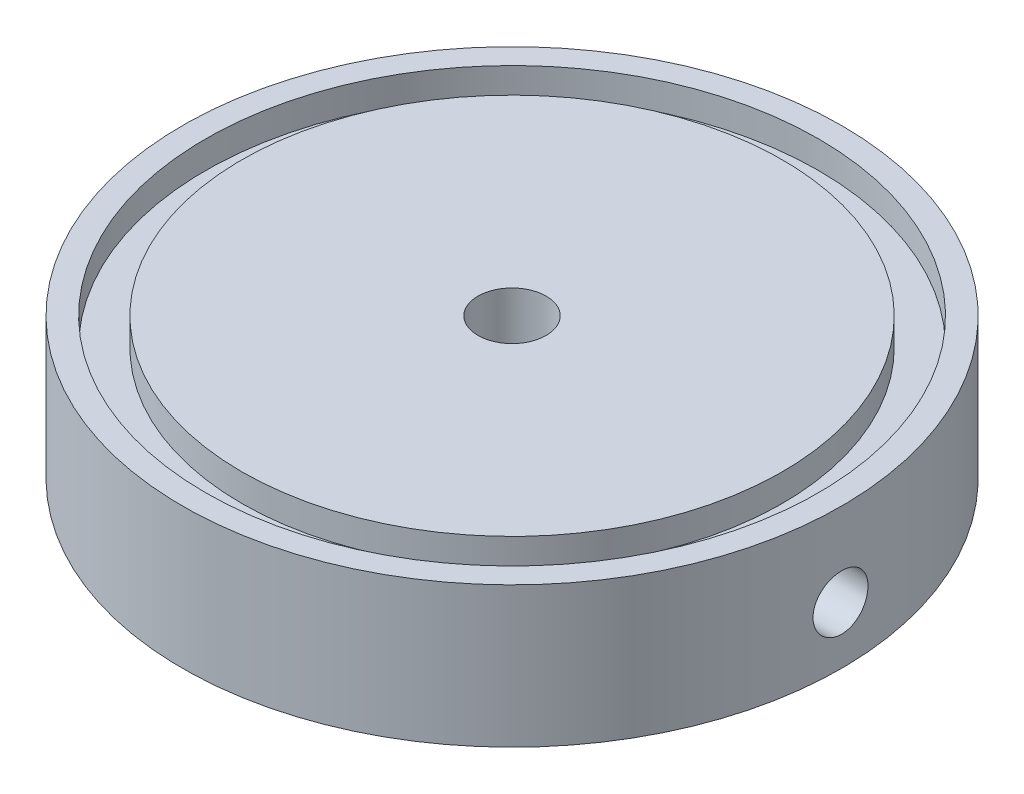
ISO-10303-21;
HEADER;
FILE_DESCRIPTION(('STEP AP214'),'2;1');
FILE_NAME('part.step','',(''),(''),'','','');
FILE_SCHEMA(('AUTOMOTIVE_DESIGN { 1 0 10303 214 1 1 1 1 }'));
ENDSEC;
DATA;
#1=APPLICATION_CONTEXT('core data for automotive mechanical design processes');
#2=APPLICATION_PROTOCOL_DEFINITION('international standard','automotive_design',2000,#1);
#3=PRODUCT_CONTEXT('',#1,'mechanical');
#4=PRODUCT('Part','Part','',(#3));
#5=PRODUCT_RELATED_PRODUCT_CATEGORY('part','',(#4));
#6=PRODUCT_DEFINITION_FORMATION('','',#4);
#7=PRODUCT_DEFINITION_CONTEXT('part definition',#1,'design');
#8=PRODUCT_DEFINITION('design','',#6,#7);
#9=PRODUCT_DEFINITION_SHAPE('','',#8);
#10=(LENGTH_UNIT() NAMED_UNIT(*) SI_UNIT(.MILLI.,.METRE.));
#11=(NAMED_UNIT(*) PLANE_ANGLE_UNIT() SI_UNIT($,.RADIAN.));
#12=(NAMED_UNIT(*) SI_UNIT($,.STERADIAN.) SOLID_ANGLE_UNIT());
#13=UNCERTAINTY_MEASURE_WITH_UNIT(LENGTH_MEASURE(1.E-05),#10,'distance_accuracy_value','');
#14=(GEOMETRIC_REPRESENTATION_CONTEXT(3) GLOBAL_UNCERTAINTY_ASSIGNED_CONTEXT((#13)) GLOBAL_UNIT_ASSIGNED_CONTEXT((#10,
#11,#12)) REPRESENTATION_CONTEXT('',''));
#15=CARTESIAN_POINT('',(0.,0.,0.));
#16=DIRECTION('',(0.,0.,1.));
#17=DIRECTION('',(1.,0.,0.));
#18=AXIS2_PLACEMENT_3D('',#15,#16,#17);
#19=CARTESIAN_POINT('',(38.1,-2.21742000000442,0.));
#20=DIRECTION('',(-1.,0.,0.));
#21=DIRECTION('',(0.,0.,1.));
#22=AXIS2_PLACEMENT_3D('',#19,#20,#21);
#23=CYLINDRICAL_SURFACE('',#22,1.7272);
#24=CARTESIAN_POINT('',(4.78697067852523,-0.665171235261735,-0.757458653891286));
#25=CARTESIAN_POINT('',(4.75625422953606,-0.635930548996629,-0.697533372590927));
#26=CARTESIAN_POINT('',(4.72893216465884,-0.609470565960408,-0.634482388105727));
#27=CARTESIAN_POINT('',(4.68213605994151,-0.563643555776028,-0.50306921919846));
#28=CARTESIAN_POINT('',(4.66266042825234,-0.544275090005549,-0.43470811542969));
#29=CARTESIAN_POINT('',(4.63231211537771,-0.513889935709503,-0.293951985284614));
#30=CARTESIAN_POINT('',(4.62147760516662,-0.502910312618153,-0.221540556224796));
#31=CARTESIAN_POINT('',(4.60903870850558,-0.490291871867994,-0.0751217236692977));
#32=CARTESIAN_POINT('',(4.60743266312804,-0.4886513753893,-0.00111460941827956));
#33=CARTESIAN_POINT('',(4.61336361058703,-0.494679348910777,0.14245074301311));
#34=CARTESIAN_POINT('',(4.62045190693207,-0.501890992455949,0.212047848188066));
#35=CARTESIAN_POINT('',(4.64273463588662,-0.52434487711953,0.348574343831421));
#36=CARTESIAN_POINT('',(4.65792891984075,-0.539586970967784,0.415503783197841));
#37=CARTESIAN_POINT('',(4.69608404535905,-0.577354018883261,0.545967186595631));
#38=CARTESIAN_POINT('',(4.71914668265209,-0.599974248749584,0.609443314302014));
#39=CARTESIAN_POINT('',(4.77210476899229,-0.651100559562644,0.730899392454943));
#40=CARTESIAN_POINT('',(4.8020029862676,-0.67960902463503,0.78887710269346));
#41=CARTESIAN_POINT('',(4.88192024901478,-0.754526280160981,0.922671170204856));
#42=CARTESIAN_POINT('',(4.93503823722558,-0.803331738258821,0.995297986812561));
#43=CARTESIAN_POINT('',(5.05039924550062,-0.906776183432052,1.12807541459497));
#44=CARTESIAN_POINT('',(5.11266285154989,-0.961428253273451,1.18819712022933));
#45=CARTESIAN_POINT('',(5.27630299315434,-1.10192049508507,1.32385964569084));
#46=CARTESIAN_POINT('',(5.3817783180933,-1.18980158095095,1.39228992218148));
#47=CARTESIAN_POINT('',(5.60174638633848,-1.36815861695864,1.5077448471841));
#48=CARTESIAN_POINT('',(5.71625795579938,-1.45863972073563,1.55472334408847));
#49=CARTESIAN_POINT('',(5.92763078684595,-1.6221177422067,1.62328310146144));
#50=CARTESIAN_POINT('',(6.02354233176437,-1.69505896722171,1.64804007283235));
#51=CARTESIAN_POINT('',(6.21772870089238,-1.84064222160262,1.68729031027404));
#52=CARTESIAN_POINT('',(6.31600494010158,-1.91328403974576,1.70177726461788));
#53=CARTESIAN_POINT('',(6.51422110198702,-2.05805523217336,1.72138595920732));
#54=CARTESIAN_POINT('',(6.61416464288552,-2.13018281605391,1.72648360307503));
#55=CARTESIAN_POINT('',(6.81474196617157,-2.27348375977993,1.72777573553129));
#56=CARTESIAN_POINT('',(6.91537557639753,-2.34465734541485,1.72397236958763));
#57=CARTESIAN_POINT('',(7.12168455036751,-2.48933143282605,1.70729152009641));
#58=CARTESIAN_POINT('',(7.22736495397619,-2.56277469486742,1.69397784330079));
#59=CARTESIAN_POINT('',(7.43816471586283,-2.70817059405486,1.65770938961245));
#60=CARTESIAN_POINT('',(7.54328385102441,-2.78012266704927,1.63475103133998));
#61=CARTESIAN_POINT('',(7.75166250948726,-2.92184595478182,1.57885512147153));
#62=CARTESIAN_POINT('',(7.85492808751473,-2.99162522016489,1.54596092672259));
#63=CARTESIAN_POINT('',(8.05894219324114,-3.12874148339489,1.46931337138522));
#64=CARTESIAN_POINT('',(8.15969293261694,-3.19608065255697,1.42556995117591));
#65=CARTESIAN_POINT('',(8.34279146757036,-3.31790402197057,1.33308588479146));
#66=CARTESIAN_POINT('',(8.42567839901411,-3.37282958961099,1.28600741540689));
#67=CARTESIAN_POINT('',(8.58722294170047,-3.47952178902698,1.18148485729486));
#68=CARTESIAN_POINT('',(8.66587290467,-3.5312827295557,1.12402278843746));
#69=CARTESIAN_POINT('',(8.81730672629618,-3.63066638778965,0.996297196430853));
#70=CARTESIAN_POINT('',(8.89000397489234,-3.67822860021844,0.92588119298211));
#71=CARTESIAN_POINT('',(9.02390983800553,-3.76564177324054,0.770767288220577));
#72=CARTESIAN_POINT('',(9.08516940480062,-3.80552695907134,0.686136080992624));
#73=CARTESIAN_POINT('',(9.16525579997495,-3.85759296052293,0.543951134303041));
#74=CARTESIAN_POINT('',(9.19067638740805,-3.87410210849061,0.491712966462728));
#75=CARTESIAN_POINT('',(9.23445776303899,-3.90251839072471,0.383148433261553));
#76=CARTESIAN_POINT('',(9.25282485409157,-3.91442963363101,0.326825771481761));
#77=CARTESIAN_POINT('',(9.2810805548836,-3.93274790973384,0.210605150804604));
#78=CARTESIAN_POINT('',(9.29088987886069,-3.93910347186559,0.150679144383298));
#79=CARTESIAN_POINT('',(9.30064503860262,-3.94542396950302,0.0296980409525031));
#80=CARTESIAN_POINT('',(9.30059713576054,-3.94539296181135,-0.0313563146720226));
#81=CARTESIAN_POINT('',(9.29122890951459,-3.93932310941666,-0.14549919115933));
#82=CARTESIAN_POINT('',(9.28294617064534,-3.93395654173932,-0.19871495761312));
#83=CARTESIAN_POINT('',(9.25936944941119,-3.91867309715279,-0.302875861226293));
#84=CARTESIAN_POINT('',(9.24407157626598,-3.90875369511765,-0.353819721098759));
#85=CARTESIAN_POINT('',(9.20096314906789,-3.88078203616598,-0.470334270253999));
#86=CARTESIAN_POINT('',(9.17063082628091,-3.8610876329992,-0.534571115967057));
#87=CARTESIAN_POINT('',(9.10179725928312,-3.81633686068641,-0.656447461342044));
#88=CARTESIAN_POINT('',(9.06327774394699,-3.79126849753343,-0.71407175352864));
#89=CARTESIAN_POINT('',(8.95707802252543,-3.72204583322611,-0.853427038623287));
#90=CARTESIAN_POINT('',(8.88517496885591,-3.67508247862191,-0.930507716123498));
#91=CARTESIAN_POINT('',(8.73276113117903,-3.57522834803393,-1.07099258277773));
#92=CARTESIAN_POINT('',(8.65223087948544,-3.52232415272656,-1.13436482302106));
#93=CARTESIAN_POINT('',(8.4965509103134,-3.41968473971726,-1.24199663584822));
#94=CARTESIAN_POINT('',(8.42204803621105,-3.37042166648861,-1.2876673135239));
#95=CARTESIAN_POINT('',(8.27019868913385,-3.26966196891126,-1.37123845324186));
#96=CARTESIAN_POINT('',(8.19285021193152,-3.21816376553295,-1.40913331005771));
#97=CARTESIAN_POINT('',(8.03606737113653,-3.11336290973551,-1.47798619281361));
#98=CARTESIAN_POINT('',(7.9566289112447,-3.06005664361635,-1.50892925406542));
#99=CARTESIAN_POINT('',(7.79642991727826,-2.9520721804854,-1.56434901597961));
#100=CARTESIAN_POINT('',(7.71566903621436,-2.89739362132667,-1.58882398964756));
#101=CARTESIAN_POINT('',(7.51886407635085,-2.76346880539695,-1.64078665460497));
#102=CARTESIAN_POINT('',(7.40238391256857,-2.68363910098292,-1.66514898834206));
#103=CARTESIAN_POINT('',(7.16877253520805,-2.52213916613266,-1.70212491606884));
#104=CARTESIAN_POINT('',(7.05164099265636,-2.44046792696191,-1.71473190244668));
#105=CARTESIAN_POINT('',(6.81786246557642,-2.27575422936096,-1.72818887092601));
#106=CARTESIAN_POINT('',(6.70121506046376,-2.19271359547437,-1.72905340229935));
#107=CARTESIAN_POINT('',(6.46936664569442,-2.02557001776367,-1.718551954237));
#108=CARTESIAN_POINT('',(6.35416470504726,-1.94146783596734,-1.70719430424913));
#109=CARTESIAN_POINT('',(6.10612982867684,-1.75758824532498,-1.66797102101825));
#110=CARTESIAN_POINT('',(5.97377251112206,-1.65766333372211,-1.63754625658014));
#111=CARTESIAN_POINT('',(5.78024403318545,-1.50818878630032,-1.5757846531622));
#112=CARTESIAN_POINT('',(5.71659631436929,-1.45845476401426,-1.55252396450989));
#113=CARTESIAN_POINT('',(5.59146640663726,-1.35941418178603,-1.50006247466696));
#114=CARTESIAN_POINT('',(5.52998347762886,-1.31010748018511,-1.47086372715697));
#115=CARTESIAN_POINT('',(5.38728220140971,-1.19400874201817,-1.39369146486403));
#116=CARTESIAN_POINT('',(5.30730539323905,-1.12759071336931,-1.34278304649939));
#117=CARTESIAN_POINT('',(5.15519035730813,-0.998393264074577,-1.22666501174239));
#118=CARTESIAN_POINT('',(5.08303677989516,-0.935606835294663,-1.16148418671653));
#119=CARTESIAN_POINT('',(4.97257932380863,-0.837171800965483,-1.04018392483871));
#120=CARTESIAN_POINT('',(4.93111600422493,-0.799563137637129,-0.988538194437073));
#121=CARTESIAN_POINT('',(4.85421423295613,-0.728701068483842,-0.878195991255441));
#122=CARTESIAN_POINT('',(4.81877313109346,-0.695445748384531,-0.819502639407449));
#123=CARTESIAN_POINT('',(4.78697067852523,-0.665171235261735,-0.757458653891286));
#124=B_SPLINE_CURVE_WITH_KNOTS('',3,(#24,#25,#26,#27,#28,#29,#30,#31,#32,#33,#34,#35,#36,#37,
#38,#39,#40,#41,#42,#43,#44,#45,#46,#47,#48,#49,#50,#51,#52,#53,#54,#55,#56,#57,#58,#59,#60,#61,
#62,#63,#64,#65,#66,#67,#68,#69,#70,#71,#72,#73,#74,#75,#76,#77,#78,#79,#80,#81,#82,#83,#84,#85,
#86,#87,#88,#89,#90,#91,#92,#93,#94,#95,#96,#97,#98,#99,#100,#101,#102,#103,#104,#105,#106,#107,
#108,#109,#110,#111,#112,#113,#114,#115,#116,#117,#118,#119,#120,#121,#122,#123),.UNSPECIFIED.,
.T.,.F.,(4,2,2,2,2,2,2,2,2,2,2,2,2,2,2,2,2,2,2,2,2,2,2,2,2,2,2,2,2,2,2,2,2,2,2,2,2,2,2,2,2,2,2,
2,2,2,2,2,2,4),(0.,0.220037701199797,0.440030739634494,0.660990266743245,0.881910072475531,
1.0918930860338,1.30187224885474,1.51467803475821,1.7275701544815,2.03292991566579,
2.33898785804739,2.79662553769652,3.25524319850504,3.62380199616927,3.99258710607117,
4.36231734070705,4.73195846605978,5.11974146230725,5.50766858228649,5.89392678405249,
6.27983238368667,6.60939257235968,6.93952898976279,7.27383398599623,7.60661221229129,
7.78721266741637,7.96765136419895,8.1497445532452,8.33172207552924,8.4933480581582,
8.65506379148425,8.87497648798497,9.09538520940238,9.4396527596983,9.78471421651974,
10.0852441851602,10.3859900366169,10.6873772102741,10.9888447738919,11.4181810801262,
11.8477585685627,12.2768037483284,12.705556717773,13.2099601805762,13.4619379183584,
13.7138286572654,14.0601429246107,14.4057649135186,14.6336827764579,14.8615000791056),.UNSPECIFIED.);
#125=CARTESIAN_POINT('',(4.78697067852523,-0.665171235261735,-0.757458653891286));
#126=VERTEX_POINT('',#125);
#127=EDGE_CURVE('E169',#126,#126,#124,.T.);
#128=ORIENTED_EDGE('',*,*,#127,.F.);
#129=EDGE_LOOP('',(#128));
#130=FACE_BOUND('',#129,.T.);
#131=CARTESIAN_POINT('',(28.575,-2.21742000000442,0.));
#132=DIRECTION('',(1.,0.,0.));
#133=DIRECTION('',(0.,0.,-1.));
#134=AXIS2_PLACEMENT_3D('',#131,#132,#133);
#135=CIRCLE('',#134,1.7272);
#136=CARTESIAN_POINT('',(28.575,-2.21742000000442,-1.7272));
#137=VERTEX_POINT('',#136);
#138=EDGE_CURVE('E65',#137,#137,#135,.T.);
#139=ORIENTED_EDGE('',*,*,#138,.T.);
#140=EDGE_LOOP('',(#139));
#141=FACE_BOUND('',#140,.T.);
#142=ADVANCED_FACE('F42',(#130,#141),#23,.F.);
#143=CARTESIAN_POINT('',(3.94335000000002,7.43457999999557,0.));
#144=DIRECTION('',(0.,1.,0.));
#145=DIRECTION('',(0.,0.,1.));
#146=AXIS2_PLACEMENT_3D('',#143,#144,#145);
#147=PLANE('',#146);
#148=CARTESIAN_POINT('',(0.,7.43457999999557,0.));
#149=DIRECTION('',(0.,-1.,0.));
#150=DIRECTION('',(0.,0.,-1.));
#151=AXIS2_PLACEMENT_3D('',#148,#149,#150);
#152=CIRCLE('',#151,3.94334999999996);
#153=CARTESIAN_POINT('',(0.,7.43457999999557,-3.94334999999996));
#154=VERTEX_POINT('',#153);
#155=EDGE_CURVE('E176',#154,#154,#152,.T.);
#156=ORIENTED_EDGE('',*,*,#155,.T.);
#157=EDGE_LOOP('',(#156));
#158=FACE_BOUND('',#157,.T.);
#159=CARTESIAN_POINT('',(0.,7.43457999999557,0.));
#160=DIRECTION('',(0.,1.,0.));
#161=DIRECTION('',(0.,0.,1.));
#162=AXIS2_PLACEMENT_3D('',#159,#160,#161);
#163=CIRCLE('',#162,31.242);
#164=CARTESIAN_POINT('',(0.,7.43457999999557,31.242));
#165=VERTEX_POINT('',#164);
#166=EDGE_CURVE('E328',#165,#165,#163,.T.);
#167=ORIENTED_EDGE('',*,*,#166,.T.);
#168=EDGE_LOOP('',(#167));
#169=FACE_BOUND('',#168,.T.);
#170=ADVANCED_FACE('F166',(#158,#169),#147,.T.);
#171=CARTESIAN_POINT('',(0.,-4.42701431069281E-12,0.));
#172=DIRECTION('',(0.,-1.,0.));
#173=DIRECTION('',(0.,0.,-1.));
#174=AXIS2_PLACEMENT_3D('',#171,#172,#173);
#175=CONICAL_SURFACE('',#174,3.94334999999996,0.936005153411921);
#176=CARTESIAN_POINT('',(0.,-0.380669706682652,0.));
#177=DIRECTION('',(0.,1.,0.));
#178=DIRECTION('',(0.,0.,1.));
#179=AXIS2_PLACEMENT_3D('',#176,#177,#178);
#180=CIRCLE('',#179,4.46022808609899);
#181=CARTESIAN_POINT('',(0.,-0.380669706682652,4.46022808609899));
#182=VERTEX_POINT('',#181);
#183=EDGE_CURVE('E12',#182,#182,#180,.T.);
#184=ORIENTED_EDGE('',*,*,#183,.T.);
#185=EDGE_LOOP('',(#184));
#186=FACE_BOUND('',#185,.T.);
#187=CARTESIAN_POINT('',(0.,-4.06400000000444,0.));
#188=DIRECTION('',(0.,-1.,0.));
#189=DIRECTION('',(0.,0.,-1.));
#190=AXIS2_PLACEMENT_3D('',#187,#188,#189);
#191=CIRCLE('',#190,9.46149999999993);
#192=CARTESIAN_POINT('',(0.,-4.06400000000444,-9.46149999999993));
#193=VERTEX_POINT('',#192);
#194=EDGE_CURVE('E57',#193,#193,#191,.T.);
#195=ORIENTED_EDGE('',*,*,#194,.T.);
#196=EDGE_LOOP('',(#195));
#197=FACE_BOUND('',#196,.T.);
#198=ORIENTED_EDGE('',*,*,#127,.T.);
#199=EDGE_LOOP('',(#198));
#200=FACE_BOUND('',#199,.T.);
#201=ADVANCED_FACE('F181',(#186,#197,#200),#175,.F.);
#202=CARTESIAN_POINT('',(0.,101.604645460313,0.));
#203=DIRECTION('',(0.,-1.,0.));
#204=DIRECTION('',(0.,0.,-1.));
#205=AXIS2_PLACEMENT_3D('',#202,#203,#204);
#206=CYLINDRICAL_SURFACE('',#205,38.1);
#207=CARTESIAN_POINT('',(37.967477859347,-2.21742000000442,-3.175));
#208=CARTESIAN_POINT('',(37.9674796148514,-2.03941137459055,-3.174992223886));
#209=CARTESIAN_POINT('',(37.9687432124492,-1.86128156393965,-3.15997936696993));
#210=CARTESIAN_POINT('',(37.9736610260084,-1.50995056040072,-3.10031123355846));
#211=CARTESIAN_POINT('',(37.9773179506743,-1.3367551842216,-3.05562236969804));
#212=CARTESIAN_POINT('',(37.9866053672743,-1.00043235231119,-2.93790365154258));
#213=CARTESIAN_POINT('',(37.9922347401669,-0.837299249473696,-2.86488986449255));
#214=CARTESIAN_POINT('',(38.0048313657025,-0.525642855211689,-2.69262246744107));
#215=CARTESIAN_POINT('',(38.0117983322355,-0.37711644968433,-2.59337446720523));
#216=CARTESIAN_POINT('',(38.0263052267685,-0.0984694402681578,-2.37118060325433));
#217=CARTESIAN_POINT('',(38.033846422922,0.0316084961604079,-2.24818130945098));
#218=CARTESIAN_POINT('',(38.0486404573867,0.269299582801398,-1.98208938314658));
#219=CARTESIAN_POINT('',(38.0558932830885,0.376911751528684,-1.83899587322542));
#220=CARTESIAN_POINT('',(38.0693053861151,0.566758501528934,-1.53652297885541));
#221=CARTESIAN_POINT('',(38.0754630672337,0.648956167096674,-1.3771203474996));
#222=CARTESIAN_POINT('',(38.0859774147698,0.785404484296812,-1.04671622158357));
#223=CARTESIAN_POINT('',(38.0903341127107,0.839655625094882,-0.875714930101312));
#224=CARTESIAN_POINT('',(38.0967467506224,0.91854808623849,-0.527392252134299));
#225=CARTESIAN_POINT('',(38.0988080535635,0.943258435799819,-0.35008660053762));
#226=CARTESIAN_POINT('',(38.1004158213117,0.96258127010665,0.00616674500017729));
#227=CARTESIAN_POINT('',(38.0999623328846,0.95719431455252,0.185114408344068));
#228=CARTESIAN_POINT('',(38.0965960392816,0.916531910326071,0.539104051072238));
#229=CARTESIAN_POINT('',(38.0936893421403,0.881330692867241,0.71415462348008));
#230=CARTESIAN_POINT('',(38.0857505953842,0.782154420690949,1.05585407967778));
#231=CARTESIAN_POINT('',(38.0807185255475,0.718179092201481,1.22250288351202));
#232=CARTESIAN_POINT('',(38.0690846412153,0.563187890894124,1.54290446002202));
#233=CARTESIAN_POINT('',(38.0624808988053,0.472138773144508,1.69664107794224));
#234=CARTESIAN_POINT('',(38.0484457872988,0.265608683983459,1.98667794141065));
#235=CARTESIAN_POINT('',(38.0410144014161,0.150127216994747,2.12297783318834));
#236=CARTESIAN_POINT('',(38.0261325057258,-0.102407846862345,2.37470621318252));
#237=CARTESIAN_POINT('',(38.0186820064471,-0.239525945954131,2.49007000291146));
#238=CARTESIAN_POINT('',(38.004624326273,-0.531217203748763,2.69615157657959));
#239=CARTESIAN_POINT('',(37.9980171460728,-0.685790376840318,2.78686934020215));
#240=CARTESIAN_POINT('',(37.9863929785793,-1.00804944367989,2.94108125458357));
#241=CARTESIAN_POINT('',(37.9813761874431,-1.17573695176081,3.00457204753268));
#242=CARTESIAN_POINT('',(37.9735046116394,-1.51944297981634,3.10247984731552));
#243=CARTESIAN_POINT('',(37.9706497815192,-1.69546132456204,3.136897465381));
#244=CARTESIAN_POINT('',(37.967432729465,-2.05026636731748,3.17560002074756));
#245=CARTESIAN_POINT('',(37.9670630442666,-2.22904315889829,3.17997518092429));
#246=CARTESIAN_POINT('',(37.9688384390387,-2.584787641092,3.15870496351731));
#247=CARTESIAN_POINT('',(37.9709834955532,-2.7617553485634,3.13305986594426));
#248=CARTESIAN_POINT('',(37.9775398735957,-3.10859917966798,3.05255231894487));
#249=CARTESIAN_POINT('',(37.981947928906,-3.27848514343725,2.99773197439151));
#250=CARTESIAN_POINT('',(37.9925309166027,-3.6066478608743,2.86047288657974));
#251=CARTESIAN_POINT('',(37.9987058773397,-3.76492442821541,2.77803370016694));
#252=CARTESIAN_POINT('',(38.0121450024562,-4.06578832580058,2.58764877433316));
#253=CARTESIAN_POINT('',(38.0194117192608,-4.20833749516941,2.47964291244999));
#254=CARTESIAN_POINT('',(38.0342069443175,-4.47331446238362,2.24127735771924));
#255=CARTESIAN_POINT('',(38.0417354570727,-4.59574191391979,2.11091728021842));
#256=CARTESIAN_POINT('',(38.0562282152053,-4.8173081383243,1.83115385899478));
#257=CARTESIAN_POINT('',(38.0631910120889,-4.91638829078934,1.68170400390121));
#258=CARTESIAN_POINT('',(38.0757469329061,-5.08804517557185,1.36823511345573));
#259=CARTESIAN_POINT('',(38.0813400705265,-5.16062217273458,1.20421622371214));
#260=CARTESIAN_POINT('',(38.0905198062144,-5.27711188167546,0.866475212585343));
#261=CARTESIAN_POINT('',(38.0941089410165,-5.32106084359246,0.692765665902921));
#262=CARTESIAN_POINT('',(38.0988865697222,-5.37916540927367,0.340401843535496));
#263=CARTESIAN_POINT('',(38.1000751090659,-5.39332157697817,0.161747661511103));
#264=CARTESIAN_POINT('',(38.0999176999798,-5.39143213177133,-0.194856253656991));
#265=CARTESIAN_POINT('',(38.0985794181538,-5.37547787666705,-0.372806481371152));
#266=CARTESIAN_POINT('',(38.0935339028085,-5.31401097943029,-0.723490780794735));
#267=CARTESIAN_POINT('',(38.0898266660717,-5.26849829715076,-0.896224845419092));
#268=CARTESIAN_POINT('',(38.0804591991,-5.14922969986591,-1.23157947247479));
#269=CARTESIAN_POINT('',(38.0747990823492,-5.07547542598607,-1.39420062193183));
#270=CARTESIAN_POINT('',(38.0621590787552,-4.90182774586677,-1.7047672689544));
#271=CARTESIAN_POINT('',(38.055179212783,-4.80193475298898,-1.85271299854823));
#272=CARTESIAN_POINT('',(38.0406579324267,-4.57850235285857,-2.13019668392583));
#273=CARTESIAN_POINT('',(38.0331149513177,-4.45489534677913,-2.25968012625115));
#274=CARTESIAN_POINT('',(38.0183309031222,-4.1876657142995,-2.49611459932655));
#275=CARTESIAN_POINT('',(38.0110899095966,-4.04403824769125,-2.60306016549813));
#276=CARTESIAN_POINT('',(37.9977149749742,-3.74056592277891,-2.79152787825786));
#277=CARTESIAN_POINT('',(37.9915831336506,-3.58069118125046,-2.87300201198062));
#278=CARTESIAN_POINT('',(37.981146402472,-3.24958888837208,-3.00784546046481));
#279=CARTESIAN_POINT('',(37.9768394132918,-3.07837464582989,-3.0612470872011));
#280=CARTESIAN_POINT('',(37.971647709959,-2.79136194258297,-3.1248289611693));
#281=CARTESIAN_POINT('',(37.9700912043148,-2.67740938743211,-3.14361809063546));
#282=CARTESIAN_POINT('',(37.9680057114582,-2.44812818992463,-3.16870611338372));
#283=CARTESIAN_POINT('',(37.9674767214846,-2.33279955126678,-3.17500504023073));
#284=CARTESIAN_POINT('',(37.967477859347,-2.21742000000442,-3.175));
#285=B_SPLINE_CURVE_WITH_KNOTS('',3,(#207,#208,#209,#210,#211,#212,#213,#214,#215,#216,#217,
#218,#219,#220,#221,#222,#223,#224,#225,#226,#227,#228,#229,#230,#231,#232,#233,#234,#235,#236,
#237,#238,#239,#240,#241,#242,#243,#244,#245,#246,#247,#248,#249,#250,#251,#252,#253,#254,#255,
#256,#257,#258,#259,#260,#261,#262,#263,#264,#265,#266,#267,#268,#269,#270,#271,#272,#273,#274,
#275,#276,#277,#278,#279,#280,#281,#282,#283,#284),.UNSPECIFIED.,.T.,.F.,(4,2,2,2,2,2,2,2,2,2,2,
2,2,2,2,2,2,2,2,2,2,2,2,2,2,2,2,2,2,2,2,2,2,2,2,2,2,2,4),(0.,0.533604603517507,1.06781417349037,
1.60172115641093,2.13551406411709,2.67052206526965,3.2055534349789,3.74135834978334,
4.27715388573729,4.81169494296257,5.34622605970216,5.87943020597204,6.41263942553357,
6.94650611589526,7.4803836360617,8.01588389273743,8.55138459084428,9.08695131145285,
9.62250677207596,10.1564531576629,10.6903945629631,11.2235674807547,11.7567489539102,
12.2911969327788,12.8256541089181,13.3614392326626,13.8972190021753,14.4323190169852,
14.9674089029308,15.5008778862256,16.0343475940937,16.5677863066157,17.1012165837663,
17.6361906712906,18.1712943208452,18.7074006261176,19.2428885044878,19.5887550320896,
19.9346206302438),.UNSPECIFIED.);
#286=CARTESIAN_POINT('',(37.967477859347,-2.21742000000442,-3.175));
#287=VERTEX_POINT('',#286);
#288=EDGE_CURVE('E53',#287,#287,#285,.T.);
#289=ORIENTED_EDGE('',*,*,#288,.F.);
#290=EDGE_LOOP('',(#289));
#291=FACE_BOUND('',#290,.T.);
#292=CARTESIAN_POINT('',(0.,7.43457999999558,0.));
#293=DIRECTION('',(0.,-1.,0.));
#294=DIRECTION('',(0.,0.,-1.));
#295=AXIS2_PLACEMENT_3D('',#292,#293,#294);
#296=CIRCLE('',#295,38.1);
#297=CARTESIAN_POINT('',(0.,7.43457999999558,-38.1));
#298=VERTEX_POINT('',#297);
#299=EDGE_CURVE('E264',#298,#298,#296,.T.);
#300=ORIENTED_EDGE('',*,*,#299,.T.);
#301=EDGE_LOOP('',(#300));
#302=FACE_BOUND('',#301,.T.);
#303=CARTESIAN_POINT('',(0.,-8.82142000000442,0.));
#304=DIRECTION('',(0.,-1.,0.));
#305=DIRECTION('',(0.,0.,-1.));
#306=AXIS2_PLACEMENT_3D('',#303,#304,#305);
#307=CIRCLE('',#306,38.1);
#308=CARTESIAN_POINT('',(0.,-8.82142000000442,-38.1));
#309=VERTEX_POINT('',#308);
#310=EDGE_CURVE('E255',#309,#309,#307,.T.);
#311=ORIENTED_EDGE('',*,*,#310,.F.);
#312=EDGE_LOOP('',(#311));
#313=FACE_BOUND('',#312,.T.);
#314=ADVANCED_FACE('F67',(#291,#302,#313),#206,.T.);
#315=CARTESIAN_POINT('',(0.,-6.391948453042,0.));
#316=DIRECTION('',(0.,-1.,0.));
#317=DIRECTION('',(0.,0.,-1.));
#318=AXIS2_PLACEMENT_3D('',#315,#316,#317);
#319=TOROIDAL_SURFACE('',#318,8.44549999999992,2.54);
#320=CARTESIAN_POINT('',(0.,-6.391948453042,0.));
#321=DIRECTION('',(0.,-1.,0.));
#322=DIRECTION('',(0.,0.,-1.));
#323=AXIS2_PLACEMENT_3D('',#320,#321,#322);
#324=CIRCLE('',#323,10.9854999999999);
#325=CARTESIAN_POINT('',(0.,-6.391948453042,-10.9854999999999));
#326=VERTEX_POINT('',#325);
#327=EDGE_CURVE('E275',#326,#326,#324,.T.);
#328=ORIENTED_EDGE('',*,*,#327,.T.);
#329=EDGE_LOOP('',(#328));
#330=FACE_BOUND('',#329,.T.);
#331=ORIENTED_EDGE('',*,*,#194,.F.);
#332=EDGE_LOOP('',(#331));
#333=FACE_BOUND('',#332,.T.);
#334=ADVANCED_FACE('F185',(#330,#333),#319,.F.);
#335=CARTESIAN_POINT('',(0.,101.604645460313,0.));
#336=DIRECTION('',(0.,-1.,0.));
#337=DIRECTION('',(0.,0.,-1.));
#338=AXIS2_PLACEMENT_3D('',#335,#336,#337);
#339=CYLINDRICAL_SURFACE('',#338,10.9854999999999);
#340=CARTESIAN_POINT('',(0.,-8.82650000000443,0.));
#341=DIRECTION('',(0.,-1.,0.));
#342=DIRECTION('',(0.,0.,-1.));
#343=AXIS2_PLACEMENT_3D('',#340,#341,#342);
#344=CIRCLE('',#343,10.9854999999999);
#345=CARTESIAN_POINT('',(0.,-8.82650000000443,-10.9854999999999));
#346=VERTEX_POINT('',#345);
#347=EDGE_CURVE('E272',#346,#346,#344,.T.);
#348=ORIENTED_EDGE('',*,*,#347,.T.);
#349=EDGE_LOOP('',(#348));
#350=FACE_BOUND('',#349,.T.);
#351=ORIENTED_EDGE('',*,*,#327,.F.);
#352=EDGE_LOOP('',(#351));
#353=FACE_BOUND('',#352,.T.);
#354=ADVANCED_FACE('F188',(#350,#353),#339,.F.);
#355=CARTESIAN_POINT('',(10.9855,-8.82650000000443,0.));
#356=DIRECTION('',(0.,-1.,0.));
#357=DIRECTION('',(0.,0.,-1.));
#358=AXIS2_PLACEMENT_3D('',#355,#356,#357);
#359=PLANE('',#358);
#360=CARTESIAN_POINT('',(0.,-8.82650000000443,0.));
#361=DIRECTION('',(0.,-1.,0.));
#362=DIRECTION('',(0.,0.,-1.));
#363=AXIS2_PLACEMENT_3D('',#360,#361,#362);
#364=CIRCLE('',#363,21.1454999999999);
#365=CARTESIAN_POINT('',(0.,-8.82650000000443,-21.1454999999999));
#366=VERTEX_POINT('',#365);
#367=EDGE_CURVE('E269',#366,#366,#364,.T.);
#368=ORIENTED_EDGE('',*,*,#367,.T.);
#369=EDGE_LOOP('',(#368));
#370=FACE_BOUND('',#369,.T.);
#371=ORIENTED_EDGE('',*,*,#347,.F.);
#372=EDGE_LOOP('',(#371));
#373=FACE_BOUND('',#372,.T.);
#374=ADVANCED_FACE('F192',(#370,#373),#359,.T.);
#375=CARTESIAN_POINT('',(0.,101.604645460313,0.));
#376=DIRECTION('',(0.,-1.,0.));
#377=DIRECTION('',(0.,0.,-1.));
#378=AXIS2_PLACEMENT_3D('',#375,#376,#377);
#379=CYLINDRICAL_SURFACE('',#378,21.1454999999999);
#380=CARTESIAN_POINT('',(0.,-7.81050000000444,0.));
#381=DIRECTION('',(0.,-1.,0.));
#382=DIRECTION('',(0.,0.,-1.));
#383=AXIS2_PLACEMENT_3D('',#380,#381,#382);
#384=CIRCLE('',#383,21.1454999999999);
#385=CARTESIAN_POINT('',(0.,-7.81050000000444,-21.1454999999999));
#386=VERTEX_POINT('',#385);
#387=EDGE_CURVE('E262',#386,#386,#384,.T.);
#388=ORIENTED_EDGE('',*,*,#387,.T.);
#389=EDGE_LOOP('',(#388));
#390=FACE_BOUND('',#389,.T.);
#391=ORIENTED_EDGE('',*,*,#367,.F.);
#392=EDGE_LOOP('',(#391));
#393=FACE_BOUND('',#392,.T.);
#394=ADVANCED_FACE('F196',(#390,#393),#379,.T.);
#395=CARTESIAN_POINT('',(21.1455,-7.81050000000443,0.));
#396=DIRECTION('',(0.,-1.,0.));
#397=DIRECTION('',(0.,0.,-1.));
#398=AXIS2_PLACEMENT_3D('',#395,#396,#397);
#399=PLANE('',#398);
#400=CARTESIAN_POINT('',(0.,-7.81050000000444,0.));
#401=DIRECTION('',(0.,-1.,0.));
#402=DIRECTION('',(0.,0.,-1.));
#403=AXIS2_PLACEMENT_3D('',#400,#401,#402);
#404=CIRCLE('',#403,22.6694999999999);
#405=CARTESIAN_POINT('',(0.,-7.81050000000444,-22.6694999999999));
#406=VERTEX_POINT('',#405);
#407=EDGE_CURVE('E259',#406,#406,#404,.T.);
#408=ORIENTED_EDGE('',*,*,#407,.T.);
#409=EDGE_LOOP('',(#408));
#410=FACE_BOUND('',#409,.T.);
#411=ORIENTED_EDGE('',*,*,#387,.F.);
#412=EDGE_LOOP('',(#411));
#413=FACE_BOUND('',#412,.T.);
#414=ADVANCED_FACE('F200',(#410,#413),#399,.T.);
#415=CARTESIAN_POINT('',(0.,101.604645460313,0.));
#416=DIRECTION('',(0.,-1.,0.));
#417=DIRECTION('',(0.,0.,-1.));
#418=AXIS2_PLACEMENT_3D('',#415,#416,#417);
#419=CYLINDRICAL_SURFACE('',#418,22.6694999999999);
#420=CARTESIAN_POINT('',(0.,-8.82142000000442,0.));
#421=DIRECTION('',(0.,-1.,0.));
#422=DIRECTION('',(0.,0.,-1.));
#423=AXIS2_PLACEMENT_3D('',#420,#421,#422);
#424=CIRCLE('',#423,22.6694999999999);
#425=CARTESIAN_POINT('',(0.,-8.82142000000442,-22.6694999999999));
#426=VERTEX_POINT('',#425);
#427=EDGE_CURVE('E258',#426,#426,#424,.T.);
#428=ORIENTED_EDGE('',*,*,#427,.T.);
#429=EDGE_LOOP('',(#428));
#430=FACE_BOUND('',#429,.T.);
#431=ORIENTED_EDGE('',*,*,#407,.F.);
#432=EDGE_LOOP('',(#431));
#433=FACE_BOUND('',#432,.T.);
#434=ADVANCED_FACE('F204',(#430,#433),#419,.F.);
#435=CARTESIAN_POINT('',(22.6695,-8.82142000000442,0.));
#436=DIRECTION('',(0.,-1.,0.));
#437=DIRECTION('',(0.,0.,-1.));
#438=AXIS2_PLACEMENT_3D('',#435,#436,#437);
#439=PLANE('',#438);
#440=CARTESIAN_POINT('',(-4.85173008401352,-8.82142000000442,-27.5155286191612));
#441=DIRECTION('',(0.,-1.,0.));
#442=DIRECTION('',(-0.64278760968653,0.,-0.766044443118986));
#443=AXIS2_PLACEMENT_3D('',#440,#441,#442);
#444=CIRCLE('',#443,1.03251);
#445=CARTESIAN_POINT('',(-5.51541471889096,-8.82142000000442,-28.306477167126));
#446=VERTEX_POINT('',#445);
#447=EDGE_CURVE('E219',#446,#446,#444,.T.);
#448=ORIENTED_EDGE('',*,*,#447,.F.);
#449=EDGE_LOOP('',(#448));
#450=FACE_BOUND('',#449,.T.);
#451=CARTESIAN_POINT('',(-21.403281740744,-8.82142000000442,-17.9594858146423));
#452=DIRECTION('',(0.,-1.,0.));
#453=DIRECTION('',(-0.984807753012206,0.,-0.17364817766694));
#454=AXIS2_PLACEMENT_3D('',#451,#452,#453);
#455=CIRCLE('',#454,1.03251);
#456=CARTESIAN_POINT('',(-22.4201055938066,-8.82142000000442,-18.1387792945652));
#457=VERTEX_POINT('',#456);
#458=EDGE_CURVE('E223',#457,#457,#455,.T.);
#459=ORIENTED_EDGE('',*,*,#458,.F.);
#460=EDGE_LOOP('',(#459));
#461=FACE_BOUND('',#460,.T.);
#462=CARTESIAN_POINT('',(-27.94,-8.82142000000442,-4.47558656802016E-13));
#463=DIRECTION('',(0.,-1.,0.));
#464=DIRECTION('',(-0.866025403784443,0.,0.499999999999992));
#465=AXIS2_PLACEMENT_3D('',#462,#463,#464);
#466=CIRCLE('',#465,1.03251);
#467=CARTESIAN_POINT('',(-28.8341798896615,-8.82142000000442,0.516254999999544));
#468=VERTEX_POINT('',#467);
#469=EDGE_CURVE('E227',#468,#468,#466,.T.);
#470=ORIENTED_EDGE('',*,*,#469,.F.);
#471=EDGE_LOOP('',(#470));
#472=FACE_BOUND('',#471,.T.);
#473=CARTESIAN_POINT('',(-21.4032817407445,-8.82142000000442,17.9594858146416));
#474=DIRECTION('',(0.,-1.,0.));
#475=DIRECTION('',(-0.342020143325676,0.,0.939692620785906));
#476=AXIS2_PLACEMENT_3D('',#473,#474,#475);
#477=CIRCLE('',#476,1.03251);
#478=CARTESIAN_POINT('',(-21.7564209589297,-8.82142000000442,18.9297278425293));
#479=VERTEX_POINT('',#478);
#480=EDGE_CURVE('E231',#479,#479,#477,.T.);
#481=ORIENTED_EDGE('',*,*,#480,.F.);
#482=EDGE_LOOP('',(#481));
#483=FACE_BOUND('',#482,.T.);
#484=CARTESIAN_POINT('',(-4.85173008401439,-8.82142000000442,27.5155286191611));
#485=DIRECTION('',(0.,-1.,0.));
#486=DIRECTION('',(0.342020143325663,0.,0.939692620785911));
#487=AXIS2_PLACEMENT_3D('',#484,#485,#486);
#488=CIRCLE('',#487,1.03251);
#489=CARTESIAN_POINT('',(-4.49859086582921,-8.82142000000442,28.4857706470487));
#490=VERTEX_POINT('',#489);
#491=EDGE_CURVE('E235',#490,#490,#488,.T.);
#492=ORIENTED_EDGE('',*,*,#491,.F.);
#493=EDGE_LOOP('',(#492));
#494=FACE_BOUND('',#493,.T.);
#495=CARTESIAN_POINT('',(13.9699999999997,-8.82142000000442,24.1967497817374));
#496=DIRECTION('',(0.,-1.,0.));
#497=DIRECTION('',(0.866025403784436,0.,0.500000000000004));
#498=AXIS2_PLACEMENT_3D('',#495,#496,#497);
#499=CIRCLE('',#498,1.03251);
#500=CARTESIAN_POINT('',(14.8641798896612,-8.82142000000442,24.7130047817374));
#501=VERTEX_POINT('',#500);
#502=EDGE_CURVE('E239',#501,#501,#499,.T.);
#503=ORIENTED_EDGE('',*,*,#502,.F.);
#504=EDGE_LOOP('',(#503));
#505=FACE_BOUND('',#504,.T.);
#506=CARTESIAN_POINT('',(26.2550118247582,-8.82142000000442,9.55604280451945));
#507=DIRECTION('',(0.,-1.,0.));
#508=DIRECTION('',(0.984807753012209,0.,-0.173648177666927));
#509=AXIS2_PLACEMENT_3D('',#506,#507,#508);
#510=CIRCLE('',#509,1.03251);
#511=CARTESIAN_POINT('',(27.2718356778208,-8.82142000000442,9.37674932459657));
#512=VERTEX_POINT('',#511);
#513=EDGE_CURVE('E243',#512,#512,#510,.T.);
#514=ORIENTED_EDGE('',*,*,#513,.F.);
#515=EDGE_LOOP('',(#514));
#516=FACE_BOUND('',#515,.T.);
#517=CARTESIAN_POINT('',(26.2550118247584,-8.82142000000442,-9.55604280451898));
#518=DIRECTION('',(0.,-1.,0.));
#519=DIRECTION('',(0.642787609686541,0.,-0.766044443118977));
#520=AXIS2_PLACEMENT_3D('',#517,#518,#519);
#521=CIRCLE('',#520,1.03251);
#522=CARTESIAN_POINT('',(26.9186964596358,-8.82142000000442,-10.3469913524838));
#523=VERTEX_POINT('',#522);
#524=EDGE_CURVE('E247',#523,#523,#521,.T.);
#525=ORIENTED_EDGE('',*,*,#524,.F.);
#526=EDGE_LOOP('',(#525));
#527=FACE_BOUND('',#526,.T.);
#528=CARTESIAN_POINT('',(13.9700000000002,-8.82142000000442,-24.1967497817372));
#529=DIRECTION('',(0.,-1.,0.));
#530=DIRECTION('',(0.,0.,-1.));
#531=AXIS2_PLACEMENT_3D('',#528,#529,#530);
#532=CIRCLE('',#531,1.03251);
#533=CARTESIAN_POINT('',(13.9700000000002,-8.82142000000442,-25.2292597817372));
#534=VERTEX_POINT('',#533);
#535=EDGE_CURVE('E251',#534,#534,#532,.T.);
#536=ORIENTED_EDGE('',*,*,#535,.F.);
#537=EDGE_LOOP('',(#536));
#538=FACE_BOUND('',#537,.T.);
#539=ORIENTED_EDGE('',*,*,#310,.T.);
#540=EDGE_LOOP('',(#539));
#541=FACE_BOUND('',#540,.T.);
#542=ORIENTED_EDGE('',*,*,#427,.F.);
#543=EDGE_LOOP('',(#542));
#544=FACE_BOUND('',#543,.T.);
#545=ADVANCED_FACE('F207',(#450,#461,#472,#483,#494,#505,#516,#527,#538,#541,#544),#439,.T.);
#546=CARTESIAN_POINT('',(0.,7.43457999999557,0.));
#547=DIRECTION('',(0.,1.,0.));
#548=DIRECTION('',(0.,0.,1.));
#549=AXIS2_PLACEMENT_3D('',#546,#547,#548);
#550=CIRCLE('',#549,35.433);
#551=CARTESIAN_POINT('',(0.,7.43457999999557,35.433));
#552=VERTEX_POINT('',#551);
#553=EDGE_CURVE('E178',#552,#552,#550,.T.);
#554=ORIENTED_EDGE('',*,*,#553,.F.);
#555=EDGE_LOOP('',(#554));
#556=FACE_BOUND('',#555,.T.);
#557=ORIENTED_EDGE('',*,*,#299,.F.);
#558=EDGE_LOOP('',(#557));
#559=FACE_BOUND('',#558,.T.);
#560=ADVANCED_FACE('F210',(#556,#559),#147,.T.);
#561=CARTESIAN_POINT('',(0.,101.604645460313,0.));
#562=DIRECTION('',(0.,-1.,0.));
#563=DIRECTION('',(0.,0.,-1.));
#564=AXIS2_PLACEMENT_3D('',#561,#562,#563);
#565=CYLINDRICAL_SURFACE('',#564,3.94334999999996);
#566=CARTESIAN_POINT('',(0.,0.641928642036008,0.));
#567=DIRECTION('',(0.,1.,0.));
#568=DIRECTION('',(0.,0.,1.));
#569=AXIS2_PLACEMENT_3D('',#566,#567,#568);
#570=CIRCLE('',#569,3.94334999999996);
#571=CARTESIAN_POINT('',(0.,0.641928642036008,3.94334999999996));
#572=VERTEX_POINT('',#571);
#573=EDGE_CURVE('E49',#572,#572,#570,.F.);
#574=ORIENTED_EDGE('',*,*,#573,.T.);
#575=EDGE_LOOP('',(#574));
#576=FACE_BOUND('',#575,.T.);
#577=ORIENTED_EDGE('',*,*,#155,.F.);
#578=EDGE_LOOP('',(#577));
#579=FACE_BOUND('',#578,.T.);
#580=ADVANCED_FACE('F161',(#576,#579),#565,.F.);
#581=CARTESIAN_POINT('',(0.,4.25957999999557,0.));
#582=DIRECTION('',(0.,1.,0.));
#583=DIRECTION('',(0.,0.,1.));
#584=AXIS2_PLACEMENT_3D('',#581,#582,#583);
#585=CYLINDRICAL_SURFACE('',#584,35.433);
#586=CARTESIAN_POINT('',(0.,4.25957999999557,0.));
#587=DIRECTION('',(0.,1.,0.));
#588=DIRECTION('',(0.,0.,1.));
#589=AXIS2_PLACEMENT_3D('',#586,#587,#588);
#590=CIRCLE('',#589,35.433);
#591=CARTESIAN_POINT('',(0.,4.25957999999557,35.433));
#592=VERTEX_POINT('',#591);
#593=EDGE_CURVE('E177',#592,#592,#590,.T.);
#594=ORIENTED_EDGE('',*,*,#593,.F.);
#595=EDGE_LOOP('',(#594));
#596=FACE_BOUND('',#595,.T.);
#597=ORIENTED_EDGE('',*,*,#553,.T.);
#598=EDGE_LOOP('',(#597));
#599=FACE_BOUND('',#598,.T.);
#600=ADVANCED_FACE('F157',(#596,#599),#585,.F.);
#601=CARTESIAN_POINT('',(0.,4.25957999999557,0.));
#602=DIRECTION('',(0.,1.,0.));
#603=DIRECTION('',(0.,0.,1.));
#604=AXIS2_PLACEMENT_3D('',#601,#602,#603);
#605=PLANE('',#604);
#606=CARTESIAN_POINT('',(0.,4.25957999999557,0.));
#607=DIRECTION('',(0.,1.,0.));
#608=DIRECTION('',(0.,0.,1.));
#609=AXIS2_PLACEMENT_3D('',#606,#607,#608);
#610=CIRCLE('',#609,31.242);
#611=CARTESIAN_POINT('',(0.,4.25957999999557,31.242));
#612=VERTEX_POINT('',#611);
#613=EDGE_CURVE('E330',#612,#612,#610,.T.);
#614=ORIENTED_EDGE('',*,*,#613,.F.);
#615=EDGE_LOOP('',(#614));
#616=FACE_BOUND('',#615,.T.);
#617=ORIENTED_EDGE('',*,*,#593,.T.);
#618=EDGE_LOOP('',(#617));
#619=FACE_BOUND('',#618,.T.);
#620=ADVANCED_FACE('F153',(#616,#619),#605,.T.);
#621=CARTESIAN_POINT('',(0.,4.25957999999557,0.));
#622=DIRECTION('',(0.,1.,0.));
#623=DIRECTION('',(0.,0.,1.));
#624=AXIS2_PLACEMENT_3D('',#621,#622,#623);
#625=CYLINDRICAL_SURFACE('',#624,31.242);
#626=ORIENTED_EDGE('',*,*,#613,.T.);
#627=EDGE_LOOP('',(#626));
#628=FACE_BOUND('',#627,.T.);
#629=ORIENTED_EDGE('',*,*,#166,.F.);
#630=EDGE_LOOP('',(#629));
#631=FACE_BOUND('',#630,.T.);
#632=ADVANCED_FACE('F149',(#628,#631),#625,.T.);
#633=CARTESIAN_POINT('',(13.9700000000002,-5.64642000000442,-24.1967497817372));
#634=DIRECTION('',(0.,-1.,0.));
#635=DIRECTION('',(0.,0.,-1.));
#636=AXIS2_PLACEMENT_3D('',#633,#634,#635);
#637=CYLINDRICAL_SURFACE('',#636,1.03251);
#638=CARTESIAN_POINT('',(13.9700000000002,-5.64642000000442,-24.1967497817372));
#639=DIRECTION('',(0.,-1.,0.));
#640=DIRECTION('',(0.,0.,-1.));
#641=AXIS2_PLACEMENT_3D('',#638,#639,#640);
#642=CIRCLE('',#641,1.03251);
#643=CARTESIAN_POINT('',(13.9700000000002,-5.64642000000442,-25.2292597817372));
#644=VERTEX_POINT('',#643);
#645=EDGE_CURVE('E325',#644,#644,#642,.T.);
#646=ORIENTED_EDGE('',*,*,#645,.F.);
#647=EDGE_LOOP('',(#646));
#648=FACE_BOUND('',#647,.T.);
#649=ORIENTED_EDGE('',*,*,#535,.T.);
#650=EDGE_LOOP('',(#649));
#651=FACE_BOUND('',#650,.T.);
#652=ADVANCED_FACE('F145',(#648,#651),#637,.F.);
#653=CARTESIAN_POINT('',(13.9700000000002,-5.64642000000442,-24.1967497817372));
#654=DIRECTION('',(0.,-1.,0.));
#655=DIRECTION('',(0.,0.,-1.));
#656=AXIS2_PLACEMENT_3D('',#653,#654,#655);
#657=PLANE('',#656);
#658=ORIENTED_EDGE('',*,*,#645,.T.);
#659=EDGE_LOOP('',(#658));
#660=FACE_BOUND('',#659,.T.);
#661=ADVANCED_FACE('F141',(#660),#657,.T.);
#662=CARTESIAN_POINT('',(26.2550118247584,-5.64642000000442,-9.55604280451898));
#663=DIRECTION('',(0.,-1.,0.));
#664=DIRECTION('',(0.,0.,-1.));
#665=AXIS2_PLACEMENT_3D('',#662,#663,#664);
#666=CYLINDRICAL_SURFACE('',#665,1.03251);
#667=CARTESIAN_POINT('',(26.2550118247584,-5.64642000000442,-9.55604280451898));
#668=DIRECTION('',(0.,-1.,0.));
#669=DIRECTION('',(0.642787609686541,0.,-0.766044443118977));
#670=AXIS2_PLACEMENT_3D('',#667,#668,#669);
#671=CIRCLE('',#670,1.03251);
#672=CARTESIAN_POINT('',(26.9186964596358,-5.64642000000442,-10.3469913524838));
#673=VERTEX_POINT('',#672);
#674=EDGE_CURVE('E321',#673,#673,#671,.T.);
#675=ORIENTED_EDGE('',*,*,#674,.F.);
#676=EDGE_LOOP('',(#675));
#677=FACE_BOUND('',#676,.T.);
#678=ORIENTED_EDGE('',*,*,#524,.T.);
#679=EDGE_LOOP('',(#678));
#680=FACE_BOUND('',#679,.T.);
#681=ADVANCED_FACE('F137',(#677,#680),#666,.F.);
#682=CARTESIAN_POINT('',(26.2550118247584,-5.64642000000442,-9.55604280451898));
#683=DIRECTION('',(0.,-1.,0.));
#684=DIRECTION('',(0.642787609686541,0.,-0.766044443118977));
#685=AXIS2_PLACEMENT_3D('',#682,#683,#684);
#686=PLANE('',#685);
#687=ORIENTED_EDGE('',*,*,#674,.T.);
#688=EDGE_LOOP('',(#687));
#689=FACE_BOUND('',#688,.T.);
#690=ADVANCED_FACE('F133',(#689),#686,.T.);
#691=CARTESIAN_POINT('',(26.2550118247582,-5.64642000000442,9.55604280451945));
#692=DIRECTION('',(0.,-1.,0.));
#693=DIRECTION('',(0.,0.,-1.));
#694=AXIS2_PLACEMENT_3D('',#691,#692,#693);
#695=CYLINDRICAL_SURFACE('',#694,1.03251);
#696=CARTESIAN_POINT('',(26.2550118247582,-5.64642000000442,9.55604280451945));
#697=DIRECTION('',(0.,-1.,0.));
#698=DIRECTION('',(0.984807753012209,0.,-0.173648177666927));
#699=AXIS2_PLACEMENT_3D('',#696,#697,#698);
#700=CIRCLE('',#699,1.03251);
#701=CARTESIAN_POINT('',(27.2718356778208,-5.64642000000442,9.37674932459657));
#702=VERTEX_POINT('',#701);
#703=EDGE_CURVE('E317',#702,#702,#700,.T.);
#704=ORIENTED_EDGE('',*,*,#703,.F.);
#705=EDGE_LOOP('',(#704));
#706=FACE_BOUND('',#705,.T.);
#707=ORIENTED_EDGE('',*,*,#513,.T.);
#708=EDGE_LOOP('',(#707));
#709=FACE_BOUND('',#708,.T.);
#710=ADVANCED_FACE('F129',(#706,#709),#695,.F.);
#711=CARTESIAN_POINT('',(26.2550118247582,-5.64642000000442,9.55604280451945));
#712=DIRECTION('',(0.,-1.,0.));
#713=DIRECTION('',(0.984807753012209,0.,-0.173648177666927));
#714=AXIS2_PLACEMENT_3D('',#711,#712,#713);
#715=PLANE('',#714);
#716=ORIENTED_EDGE('',*,*,#703,.T.);
#717=EDGE_LOOP('',(#716));
#718=FACE_BOUND('',#717,.T.);
#719=ADVANCED_FACE('F125',(#718),#715,.T.);
#720=CARTESIAN_POINT('',(13.9699999999997,-5.64642000000442,24.1967497817374));
#721=DIRECTION('',(0.,-1.,0.));
#722=DIRECTION('',(0.,0.,-1.));
#723=AXIS2_PLACEMENT_3D('',#720,#721,#722);
#724=CYLINDRICAL_SURFACE('',#723,1.03251);
#725=CARTESIAN_POINT('',(13.9699999999997,-5.64642000000442,24.1967497817374));
#726=DIRECTION('',(0.,-1.,0.));
#727=DIRECTION('',(0.866025403784436,0.,0.500000000000004));
#728=AXIS2_PLACEMENT_3D('',#725,#726,#727);
#729=CIRCLE('',#728,1.03251);
#730=CARTESIAN_POINT('',(14.8641798896612,-5.64642000000442,24.7130047817374));
#731=VERTEX_POINT('',#730);
#732=EDGE_CURVE('E313',#731,#731,#729,.T.);
#733=ORIENTED_EDGE('',*,*,#732,.F.);
#734=EDGE_LOOP('',(#733));
#735=FACE_BOUND('',#734,.T.);
#736=ORIENTED_EDGE('',*,*,#502,.T.);
#737=EDGE_LOOP('',(#736));
#738=FACE_BOUND('',#737,.T.);
#739=ADVANCED_FACE('F121',(#735,#738),#724,.F.);
#740=CARTESIAN_POINT('',(13.9699999999997,-5.64642000000442,24.1967497817374));
#741=DIRECTION('',(0.,-1.,0.));
#742=DIRECTION('',(0.866025403784436,0.,0.500000000000004));
#743=AXIS2_PLACEMENT_3D('',#740,#741,#742);
#744=PLANE('',#743);
#745=ORIENTED_EDGE('',*,*,#732,.T.);
#746=EDGE_LOOP('',(#745));
#747=FACE_BOUND('',#746,.T.);
#748=ADVANCED_FACE('F117',(#747),#744,.T.);
#749=CARTESIAN_POINT('',(-4.85173008401439,-5.64642000000442,27.5155286191611));
#750=DIRECTION('',(0.,-1.,0.));
#751=DIRECTION('',(0.,0.,-1.));
#752=AXIS2_PLACEMENT_3D('',#749,#750,#751);
#753=CYLINDRICAL_SURFACE('',#752,1.03251);
#754=CARTESIAN_POINT('',(-4.85173008401439,-5.64642000000442,27.5155286191611));
#755=DIRECTION('',(0.,-1.,0.));
#756=DIRECTION('',(0.342020143325663,0.,0.939692620785911));
#757=AXIS2_PLACEMENT_3D('',#754,#755,#756);
#758=CIRCLE('',#757,1.03251);
#759=CARTESIAN_POINT('',(-4.49859086582921,-5.64642000000442,28.4857706470487));
#760=VERTEX_POINT('',#759);
#761=EDGE_CURVE('E309',#760,#760,#758,.T.);
#762=ORIENTED_EDGE('',*,*,#761,.F.);
#763=EDGE_LOOP('',(#762));
#764=FACE_BOUND('',#763,.T.);
#765=ORIENTED_EDGE('',*,*,#491,.T.);
#766=EDGE_LOOP('',(#765));
#767=FACE_BOUND('',#766,.T.);
#768=ADVANCED_FACE('F113',(#764,#767),#753,.F.);
#769=CARTESIAN_POINT('',(-4.85173008401439,-5.64642000000442,27.5155286191611));
#770=DIRECTION('',(0.,-1.,0.));
#771=DIRECTION('',(0.342020143325663,0.,0.939692620785911));
#772=AXIS2_PLACEMENT_3D('',#769,#770,#771);
#773=PLANE('',#772);
#774=ORIENTED_EDGE('',*,*,#761,.T.);
#775=EDGE_LOOP('',(#774));
#776=FACE_BOUND('',#775,.T.);
#777=ADVANCED_FACE('F109',(#776),#773,.T.);
#778=CARTESIAN_POINT('',(-21.4032817407445,-5.64642000000442,17.9594858146416));
#779=DIRECTION('',(0.,-1.,0.));
#780=DIRECTION('',(0.,0.,-1.));
#781=AXIS2_PLACEMENT_3D('',#778,#779,#780);
#782=CYLINDRICAL_SURFACE('',#781,1.03251);
#783=CARTESIAN_POINT('',(-21.4032817407445,-5.64642000000442,17.9594858146416));
#784=DIRECTION('',(0.,-1.,0.));
#785=DIRECTION('',(-0.342020143325676,0.,0.939692620785906));
#786=AXIS2_PLACEMENT_3D('',#783,#784,#785);
#787=CIRCLE('',#786,1.03251);
#788=CARTESIAN_POINT('',(-21.7564209589297,-5.64642000000442,18.9297278425293));
#789=VERTEX_POINT('',#788);
#790=EDGE_CURVE('E305',#789,#789,#787,.T.);
#791=ORIENTED_EDGE('',*,*,#790,.F.);
#792=EDGE_LOOP('',(#791));
#793=FACE_BOUND('',#792,.T.);
#794=ORIENTED_EDGE('',*,*,#480,.T.);
#795=EDGE_LOOP('',(#794));
#796=FACE_BOUND('',#795,.T.);
#797=ADVANCED_FACE('F105',(#793,#796),#782,.F.);
#798=CARTESIAN_POINT('',(-21.4032817407445,-5.64642000000442,17.9594858146416));
#799=DIRECTION('',(0.,-1.,0.));
#800=DIRECTION('',(-0.342020143325676,0.,0.939692620785906));
#801=AXIS2_PLACEMENT_3D('',#798,#799,#800);
#802=PLANE('',#801);
#803=ORIENTED_EDGE('',*,*,#790,.T.);
#804=EDGE_LOOP('',(#803));
#805=FACE_BOUND('',#804,.T.);
#806=ADVANCED_FACE('F101',(#805),#802,.T.);
#807=CARTESIAN_POINT('',(-27.94,-5.64642000000442,-4.47558656802016E-13));
#808=DIRECTION('',(0.,-1.,0.));
#809=DIRECTION('',(0.,0.,-1.));
#810=AXIS2_PLACEMENT_3D('',#807,#808,#809);
#811=CYLINDRICAL_SURFACE('',#810,1.03251);
#812=CARTESIAN_POINT('',(-27.94,-5.64642000000442,-4.47558656802016E-13));
#813=DIRECTION('',(0.,-1.,0.));
#814=DIRECTION('',(-0.866025403784443,0.,0.499999999999992));
#815=AXIS2_PLACEMENT_3D('',#812,#813,#814);
#816=CIRCLE('',#815,1.03251);
#817=CARTESIAN_POINT('',(-28.8341798896615,-5.64642000000442,0.516254999999544));
#818=VERTEX_POINT('',#817);
#819=EDGE_CURVE('E301',#818,#818,#816,.T.);
#820=ORIENTED_EDGE('',*,*,#819,.F.);
#821=EDGE_LOOP('',(#820));
#822=FACE_BOUND('',#821,.T.);
#823=ORIENTED_EDGE('',*,*,#469,.T.);
#824=EDGE_LOOP('',(#823));
#825=FACE_BOUND('',#824,.T.);
#826=ADVANCED_FACE('F97',(#822,#825),#811,.F.);
#827=CARTESIAN_POINT('',(-27.94,-5.64642000000442,-4.47558656802016E-13));
#828=DIRECTION('',(0.,-1.,0.));
#829=DIRECTION('',(-0.866025403784443,0.,0.499999999999992));
#830=AXIS2_PLACEMENT_3D('',#827,#828,#829);
#831=PLANE('',#830);
#832=ORIENTED_EDGE('',*,*,#819,.T.);
#833=EDGE_LOOP('',(#832));
#834=FACE_BOUND('',#833,.T.);
#835=ADVANCED_FACE('F93',(#834),#831,.T.);
#836=CARTESIAN_POINT('',(-21.403281740744,-5.64642000000442,-17.9594858146423));
#837=DIRECTION('',(0.,-1.,0.));
#838=DIRECTION('',(0.,0.,-1.));
#839=AXIS2_PLACEMENT_3D('',#836,#837,#838);
#840=CYLINDRICAL_SURFACE('',#839,1.03251);
#841=CARTESIAN_POINT('',(-21.403281740744,-5.64642000000442,-17.9594858146423));
#842=DIRECTION('',(0.,-1.,0.));
#843=DIRECTION('',(-0.984807753012206,0.,-0.17364817766694));
#844=AXIS2_PLACEMENT_3D('',#841,#842,#843);
#845=CIRCLE('',#844,1.03251);
#846=CARTESIAN_POINT('',(-22.4201055938066,-5.64642000000442,-18.1387792945652));
#847=VERTEX_POINT('',#846);
#848=EDGE_CURVE('E297',#847,#847,#845,.T.);
#849=ORIENTED_EDGE('',*,*,#848,.F.);
#850=EDGE_LOOP('',(#849));
#851=FACE_BOUND('',#850,.T.);
#852=ORIENTED_EDGE('',*,*,#458,.T.);
#853=EDGE_LOOP('',(#852));
#854=FACE_BOUND('',#853,.T.);
#855=ADVANCED_FACE('F89',(#851,#854),#840,.F.);
#856=CARTESIAN_POINT('',(-21.403281740744,-5.64642000000442,-17.9594858146423));
#857=DIRECTION('',(0.,-1.,0.));
#858=DIRECTION('',(-0.984807753012206,0.,-0.17364817766694));
#859=AXIS2_PLACEMENT_3D('',#856,#857,#858);
#860=PLANE('',#859);
#861=ORIENTED_EDGE('',*,*,#848,.T.);
#862=EDGE_LOOP('',(#861));
#863=FACE_BOUND('',#862,.T.);
#864=ADVANCED_FACE('F85',(#863),#860,.T.);
#865=CARTESIAN_POINT('',(-4.85173008401352,-5.64642000000442,-27.5155286191612));
#866=DIRECTION('',(0.,-1.,0.));
#867=DIRECTION('',(0.,0.,-1.));
#868=AXIS2_PLACEMENT_3D('',#865,#866,#867);
#869=CYLINDRICAL_SURFACE('',#868,1.03251);
#870=CARTESIAN_POINT('',(-4.85173008401352,-5.64642000000442,-27.5155286191612));
#871=DIRECTION('',(0.,-1.,0.));
#872=DIRECTION('',(-0.64278760968653,0.,-0.766044443118986));
#873=AXIS2_PLACEMENT_3D('',#870,#871,#872);
#874=CIRCLE('',#873,1.03251);
#875=CARTESIAN_POINT('',(-5.51541471889096,-5.64642000000442,-28.306477167126));
#876=VERTEX_POINT('',#875);
#877=EDGE_CURVE('E288',#876,#876,#874,.T.);
#878=ORIENTED_EDGE('',*,*,#877,.F.);
#879=EDGE_LOOP('',(#878));
#880=FACE_BOUND('',#879,.T.);
#881=ORIENTED_EDGE('',*,*,#447,.T.);
#882=EDGE_LOOP('',(#881));
#883=FACE_BOUND('',#882,.T.);
#884=ADVANCED_FACE('F81',(#880,#883),#869,.F.);
#885=CARTESIAN_POINT('',(-4.85173008401352,-5.64642000000442,-27.5155286191612));
#886=DIRECTION('',(0.,-1.,0.));
#887=DIRECTION('',(-0.64278760968653,0.,-0.766044443118986));
#888=AXIS2_PLACEMENT_3D('',#885,#886,#887);
#889=PLANE('',#888);
#890=ORIENTED_EDGE('',*,*,#877,.T.);
#891=EDGE_LOOP('',(#890));
#892=FACE_BOUND('',#891,.T.);
#893=ADVANCED_FACE('F77',(#892),#889,.T.);
#894=CARTESIAN_POINT('',(28.575,-2.21742000000442,0.));
#895=DIRECTION('',(1.,0.,0.));
#896=DIRECTION('',(0.,0.,-1.));
#897=AXIS2_PLACEMENT_3D('',#894,#895,#896);
#898=CYLINDRICAL_SURFACE('',#897,3.175);
#899=ORIENTED_EDGE('',*,*,#288,.T.);
#900=EDGE_LOOP('',(#899));
#901=FACE_BOUND('',#900,.T.);
#902=CARTESIAN_POINT('',(28.575,-2.21742000000442,0.));
#903=DIRECTION('',(1.,0.,0.));
#904=DIRECTION('',(0.,0.,-1.));
#905=AXIS2_PLACEMENT_3D('',#902,#903,#904);
#906=CIRCLE('',#905,3.175);
#907=CARTESIAN_POINT('',(28.575,-2.21742000000442,-3.175));
#908=VERTEX_POINT('',#907);
#909=EDGE_CURVE('E287',#908,#908,#906,.T.);
#910=ORIENTED_EDGE('',*,*,#909,.F.);
#911=EDGE_LOOP('',(#910));
#912=FACE_BOUND('',#911,.T.);
#913=ADVANCED_FACE('F71',(#901,#912),#898,.F.);
#914=CARTESIAN_POINT('',(28.575,-2.21742000000442,0.));
#915=DIRECTION('',(1.,0.,0.));
#916=DIRECTION('',(0.,0.,-1.));
#917=AXIS2_PLACEMENT_3D('',#914,#915,#916);
#918=PLANE('',#917);
#919=ORIENTED_EDGE('',*,*,#138,.F.);
#920=EDGE_LOOP('',(#919));
#921=FACE_BOUND('',#920,.T.);
#922=ORIENTED_EDGE('',*,*,#909,.T.);
#923=EDGE_LOOP('',(#922));
#924=FACE_BOUND('',#923,.T.);
#925=ADVANCED_FACE('F76',(#921,#924),#918,.T.);
#926=CARTESIAN_POINT('',(0.,0.641928642036008,0.));
#927=DIRECTION('',(0.,1.,0.));
#928=DIRECTION('',(0.,0.,1.));
#929=AXIS2_PLACEMENT_3D('',#926,#927,#928);
#930=TOROIDAL_SURFACE('',#929,5.21334999999996,1.27);
#931=ORIENTED_EDGE('',*,*,#183,.F.);
#932=EDGE_LOOP('',(#931));
#933=FACE_BOUND('',#932,.T.);
#934=ORIENTED_EDGE('',*,*,#573,.F.);
#935=EDGE_LOOP('',(#934));
#936=FACE_BOUND('',#935,.T.);
#937=ADVANCED_FACE('F44',(#933,#936),#930,.T.);
#938=CLOSED_SHELL('',(#142,#170,#201,#314,#334,#354,#374,#394,#414,#434,#545,#560,#580,#600,
#620,#632,#652,#661,#681,#690,#710,#719,#739,#748,#768,#777,#797,#806,#826,#835,#855,#864,#884,
#893,#913,#925,#937));
#939=MANIFOLD_SOLID_BREP('B2',#938);
#940=ADVANCED_BREP_SHAPE_REPRESENTATION('',(#18,#939),#14);
#941=SHAPE_DEFINITION_REPRESENTATION(#9,#940);
ENDSEC;
END-ISO-10303-21;
